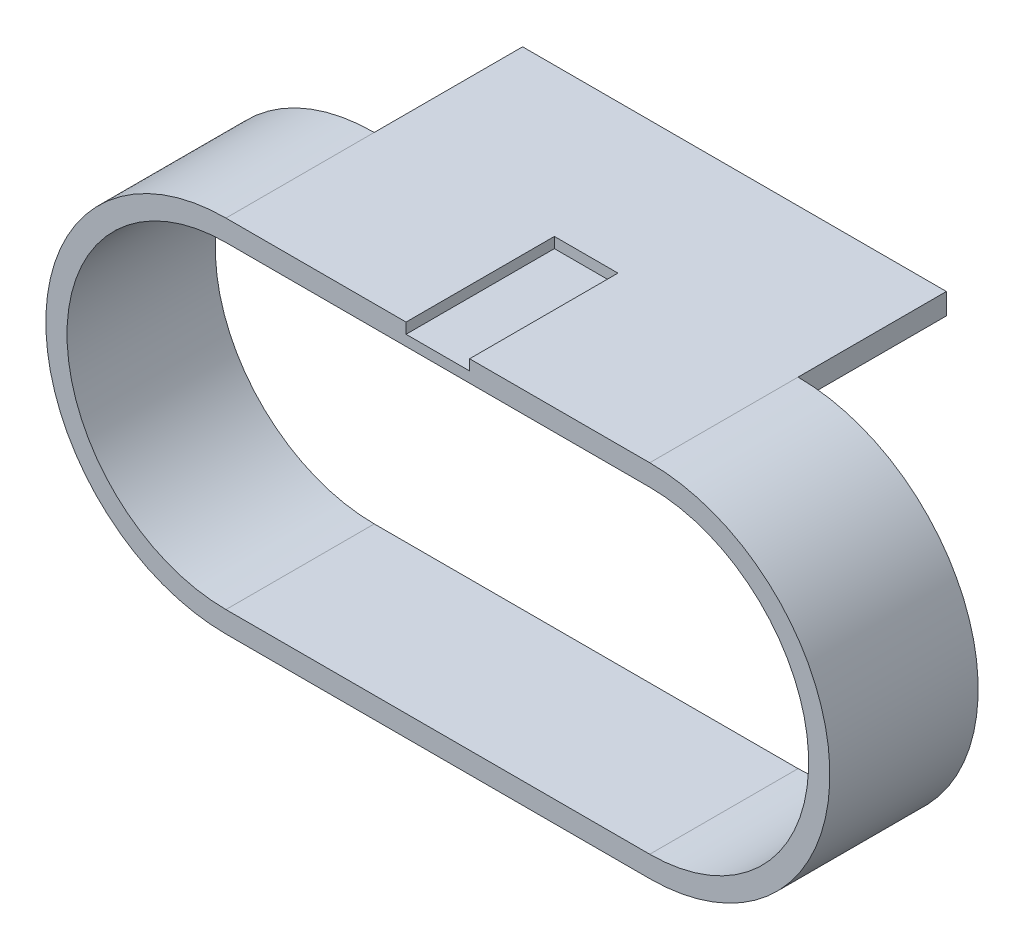
ISO-10303-21;
HEADER;
FILE_DESCRIPTION(('STEP AP214'),'2;1');
FILE_NAME('part.step','',(''),(''),'','','');
FILE_SCHEMA(('AUTOMOTIVE_DESIGN { 1 0 10303 214 1 1 1 1 }'));
ENDSEC;
DATA;
#1=APPLICATION_CONTEXT('core data for automotive mechanical design processes');
#2=APPLICATION_PROTOCOL_DEFINITION('international standard','automotive_design',2000,#1);
#3=PRODUCT_CONTEXT('',#1,'mechanical');
#4=PRODUCT('Part','Part','',(#3));
#5=PRODUCT_RELATED_PRODUCT_CATEGORY('part','',(#4));
#6=PRODUCT_DEFINITION_FORMATION('','',#4);
#7=PRODUCT_DEFINITION_CONTEXT('part definition',#1,'design');
#8=PRODUCT_DEFINITION('design','',#6,#7);
#9=PRODUCT_DEFINITION_SHAPE('','',#8);
#10=(LENGTH_UNIT() NAMED_UNIT(*) SI_UNIT(.MILLI.,.METRE.));
#11=(NAMED_UNIT(*) PLANE_ANGLE_UNIT() SI_UNIT($,.RADIAN.));
#12=(NAMED_UNIT(*) SI_UNIT($,.STERADIAN.) SOLID_ANGLE_UNIT());
#13=UNCERTAINTY_MEASURE_WITH_UNIT(LENGTH_MEASURE(1.E-05),#10,'distance_accuracy_value','');
#14=(GEOMETRIC_REPRESENTATION_CONTEXT(3) GLOBAL_UNCERTAINTY_ASSIGNED_CONTEXT((#13)) GLOBAL_UNIT_ASSIGNED_CONTEXT((#10,
#11,#12)) REPRESENTATION_CONTEXT('',''));
#15=CARTESIAN_POINT('',(0.,0.,0.));
#16=DIRECTION('',(0.,0.,1.));
#17=DIRECTION('',(1.,0.,0.));
#18=AXIS2_PLACEMENT_3D('',#15,#16,#17);
#19=CARTESIAN_POINT('',(-25.4,0.,-8.89));
#20=DIRECTION('',(0.,0.,1.));
#21=DIRECTION('',(1.,0.,0.));
#22=AXIS2_PLACEMENT_3D('',#19,#20,#21);
#23=PLANE('',#22);
#24=DIRECTION('',(0.,-1.,0.));
#25=VECTOR('',#24,1.);
#26=CARTESIAN_POINT('',(25.4,21.59,-8.89));
#27=LINE('',#26,#25);
#28=CARTESIAN_POINT('',(25.4,21.59,-8.89));
#29=VERTEX_POINT('',#28);
#30=CARTESIAN_POINT('',(25.4,19.05,-8.89));
#31=VERTEX_POINT('',#30);
#32=EDGE_CURVE('E160',#29,#31,#27,.T.);
#33=ORIENTED_EDGE('',*,*,#32,.F.);
#34=CARTESIAN_POINT('',(25.4,0.,-8.89));
#35=DIRECTION('',(0.,0.,1.));
#36=DIRECTION('',(1.,0.,0.));
#37=AXIS2_PLACEMENT_3D('',#34,#35,#36);
#38=CIRCLE('',#37,21.59);
#39=CARTESIAN_POINT('',(25.4,-21.59,-8.89));
#40=VERTEX_POINT('',#39);
#41=EDGE_CURVE('E220',#40,#29,#38,.T.);
#42=ORIENTED_EDGE('',*,*,#41,.F.);
#43=DIRECTION('',(1.,0.,0.));
#44=VECTOR('',#43,1.);
#45=CARTESIAN_POINT('',(-25.4,-21.59,-8.89));
#46=LINE('',#45,#44);
#47=CARTESIAN_POINT('',(-25.4,-21.59,-8.89));
#48=VERTEX_POINT('',#47);
#49=EDGE_CURVE('E231',#48,#40,#46,.T.);
#50=ORIENTED_EDGE('',*,*,#49,.F.);
#51=CARTESIAN_POINT('',(-25.4,0.,-8.89));
#52=DIRECTION('',(0.,0.,1.));
#53=DIRECTION('',(1.,0.,0.));
#54=AXIS2_PLACEMENT_3D('',#51,#52,#53);
#55=CIRCLE('',#54,21.59);
#56=CARTESIAN_POINT('',(-25.4,21.59,-8.89));
#57=VERTEX_POINT('',#56);
#58=EDGE_CURVE('E215',#57,#48,#55,.T.);
#59=ORIENTED_EDGE('',*,*,#58,.F.);
#60=DIRECTION('',(0.,1.,0.));
#61=VECTOR('',#60,1.);
#62=CARTESIAN_POINT('',(-25.4,21.59,-8.89));
#63=LINE('',#62,#61);
#64=CARTESIAN_POINT('',(-25.4,19.05,-8.89));
#65=VERTEX_POINT('',#64);
#66=EDGE_CURVE('E249',#65,#57,#63,.T.);
#67=ORIENTED_EDGE('',*,*,#66,.F.);
#68=CARTESIAN_POINT('',(-25.4,0.,-8.89));
#69=DIRECTION('',(0.,0.,1.));
#70=DIRECTION('',(1.,0.,0.));
#71=AXIS2_PLACEMENT_3D('',#68,#69,#70);
#72=CIRCLE('',#71,19.05);
#73=CARTESIAN_POINT('',(-25.4,-19.05,-8.89));
#74=VERTEX_POINT('',#73);
#75=EDGE_CURVE('E190',#65,#74,#72,.T.);
#76=ORIENTED_EDGE('',*,*,#75,.T.);
#77=DIRECTION('',(1.,0.,0.));
#78=VECTOR('',#77,1.);
#79=CARTESIAN_POINT('',(-25.4,-19.05,-8.89));
#80=LINE('',#79,#78);
#81=CARTESIAN_POINT('',(25.4,-19.05,-8.89));
#82=VERTEX_POINT('',#81);
#83=EDGE_CURVE('E203',#74,#82,#80,.T.);
#84=ORIENTED_EDGE('',*,*,#83,.T.);
#85=CARTESIAN_POINT('',(25.4,0.,-8.89));
#86=DIRECTION('',(0.,0.,1.));
#87=DIRECTION('',(1.,0.,0.));
#88=AXIS2_PLACEMENT_3D('',#85,#86,#87);
#89=CIRCLE('',#88,19.05);
#90=EDGE_CURVE('E194',#82,#31,#89,.T.);
#91=ORIENTED_EDGE('',*,*,#90,.T.);
#92=EDGE_LOOP('',(#33,#42,#50,#59,#67,#76,#84,#91));
#93=FACE_BOUND('',#92,.T.);
#94=ADVANCED_FACE('F37',(#93),#23,.F.);
#95=CARTESIAN_POINT('',(-25.4,0.,8.89));
#96=DIRECTION('',(0.,0.,1.));
#97=DIRECTION('',(1.,0.,0.));
#98=AXIS2_PLACEMENT_3D('',#95,#96,#97);
#99=PLANE('',#98);
#100=DIRECTION('',(1.,0.,0.));
#101=VECTOR('',#100,1.);
#102=CARTESIAN_POINT('',(-25.4,-19.05,8.89));
#103=LINE('',#102,#101);
#104=CARTESIAN_POINT('',(-25.4,-19.05,8.89));
#105=VERTEX_POINT('',#104);
#106=CARTESIAN_POINT('',(25.4,-19.05,8.89));
#107=VERTEX_POINT('',#106);
#108=EDGE_CURVE('E193',#105,#107,#103,.T.);
#109=ORIENTED_EDGE('',*,*,#108,.F.);
#110=CARTESIAN_POINT('',(-25.4,0.,8.89));
#111=DIRECTION('',(0.,0.,1.));
#112=DIRECTION('',(1.,0.,0.));
#113=AXIS2_PLACEMENT_3D('',#110,#111,#112);
#114=CIRCLE('',#113,19.05);
#115=CARTESIAN_POINT('',(-25.4,19.05,8.89));
#116=VERTEX_POINT('',#115);
#117=EDGE_CURVE('E191',#116,#105,#114,.T.);
#118=ORIENTED_EDGE('',*,*,#117,.F.);
#119=DIRECTION('',(-1.,0.,0.));
#120=VECTOR('',#119,1.);
#121=CARTESIAN_POINT('',(-25.4,19.05,8.89));
#122=LINE('',#121,#120);
#123=CARTESIAN_POINT('',(25.4,19.05,8.89));
#124=VERTEX_POINT('',#123);
#125=EDGE_CURVE('E198',#124,#116,#122,.T.);
#126=ORIENTED_EDGE('',*,*,#125,.F.);
#127=CARTESIAN_POINT('',(25.4,0.,8.89));
#128=DIRECTION('',(0.,0.,1.));
#129=DIRECTION('',(1.,0.,0.));
#130=AXIS2_PLACEMENT_3D('',#127,#128,#129);
#131=CIRCLE('',#130,19.05);
#132=EDGE_CURVE('E196',#107,#124,#131,.T.);
#133=ORIENTED_EDGE('',*,*,#132,.F.);
#134=EDGE_LOOP('',(#109,#118,#126,#133));
#135=FACE_BOUND('',#134,.T.);
#136=DIRECTION('',(-1.,0.,0.));
#137=VECTOR('',#136,1.);
#138=CARTESIAN_POINT('',(-25.4,21.59,8.89));
#139=LINE('',#138,#137);
#140=CARTESIAN_POINT('',(25.4,21.59,8.89));
#141=VERTEX_POINT('',#140);
#142=CARTESIAN_POINT('',(3.81,21.59,8.89));
#143=VERTEX_POINT('',#142);
#144=EDGE_CURVE('E225',#141,#143,#139,.T.);
#145=ORIENTED_EDGE('',*,*,#144,.T.);
#146=DIRECTION('',(0.,1.,0.));
#147=VECTOR('',#146,1.);
#148=CARTESIAN_POINT('',(3.81,20.32,8.89));
#149=LINE('',#148,#147);
#150=CARTESIAN_POINT('',(3.81,20.32,8.89));
#151=VERTEX_POINT('',#150);
#152=EDGE_CURVE('E181',#151,#143,#149,.T.);
#153=ORIENTED_EDGE('',*,*,#152,.F.);
#154=DIRECTION('',(1.,0.,0.));
#155=VECTOR('',#154,1.);
#156=CARTESIAN_POINT('',(-3.81,20.32,8.89));
#157=LINE('',#156,#155);
#158=CARTESIAN_POINT('',(-3.81,20.32,8.89));
#159=VERTEX_POINT('',#158);
#160=EDGE_CURVE('E187',#159,#151,#157,.T.);
#161=ORIENTED_EDGE('',*,*,#160,.F.);
#162=DIRECTION('',(0.,-1.,0.));
#163=VECTOR('',#162,1.);
#164=CARTESIAN_POINT('',(-3.81,20.32,8.89));
#165=LINE('',#164,#163);
#166=CARTESIAN_POINT('',(-3.81,21.59,8.89));
#167=VERTEX_POINT('',#166);
#168=EDGE_CURVE('E178',#167,#159,#165,.T.);
#169=ORIENTED_EDGE('',*,*,#168,.F.);
#170=CARTESIAN_POINT('',(-25.4,21.59,8.89));
#171=VERTEX_POINT('',#170);
#172=EDGE_CURVE('E224',#167,#171,#139,.T.);
#173=ORIENTED_EDGE('',*,*,#172,.T.);
#174=CARTESIAN_POINT('',(-25.4,0.,8.89));
#175=DIRECTION('',(0.,0.,1.));
#176=DIRECTION('',(1.,0.,0.));
#177=AXIS2_PLACEMENT_3D('',#174,#175,#176);
#178=CIRCLE('',#177,21.59);
#179=CARTESIAN_POINT('',(-25.4,-21.59,8.89));
#180=VERTEX_POINT('',#179);
#181=EDGE_CURVE('E216',#171,#180,#178,.T.);
#182=ORIENTED_EDGE('',*,*,#181,.T.);
#183=DIRECTION('',(1.,0.,0.));
#184=VECTOR('',#183,1.);
#185=CARTESIAN_POINT('',(-25.4,-21.59,8.89));
#186=LINE('',#185,#184);
#187=CARTESIAN_POINT('',(25.4,-21.59,8.89));
#188=VERTEX_POINT('',#187);
#189=EDGE_CURVE('E219',#180,#188,#186,.T.);
#190=ORIENTED_EDGE('',*,*,#189,.T.);
#191=CARTESIAN_POINT('',(25.4,0.,8.89));
#192=DIRECTION('',(0.,0.,1.));
#193=DIRECTION('',(1.,0.,0.));
#194=AXIS2_PLACEMENT_3D('',#191,#192,#193);
#195=CIRCLE('',#194,21.59);
#196=EDGE_CURVE('E222',#188,#141,#195,.T.);
#197=ORIENTED_EDGE('',*,*,#196,.T.);
#198=EDGE_LOOP('',(#145,#153,#161,#169,#173,#182,#190,#197));
#199=FACE_BOUND('',#198,.T.);
#200=ADVANCED_FACE('F278',(#135,#199),#99,.T.);
#201=CARTESIAN_POINT('',(-25.4,21.59,8.89));
#202=DIRECTION('',(0.,-1.,0.));
#203=DIRECTION('',(1.,0.,0.));
#204=AXIS2_PLACEMENT_3D('',#201,#202,#203);
#205=PLANE('',#204);
#206=DIRECTION('',(0.,0.,-1.));
#207=VECTOR('',#206,1.);
#208=CARTESIAN_POINT('',(-3.81,21.59,8.891));
#209=LINE('',#208,#207);
#210=CARTESIAN_POINT('',(-3.81,21.59,-8.89));
#211=VERTEX_POINT('',#210);
#212=EDGE_CURVE('E173',#167,#211,#209,.T.);
#213=ORIENTED_EDGE('',*,*,#212,.T.);
#214=DIRECTION('',(1.,0.,0.));
#215=VECTOR('',#214,1.);
#216=CARTESIAN_POINT('',(25.4,21.59,-8.89));
#217=LINE('',#216,#215);
#218=CARTESIAN_POINT('',(3.81,21.59,-8.89));
#219=VERTEX_POINT('',#218);
#220=EDGE_CURVE('E157',#211,#219,#217,.T.);
#221=ORIENTED_EDGE('',*,*,#220,.T.);
#222=DIRECTION('',(0.,0.,1.));
#223=VECTOR('',#222,1.);
#224=CARTESIAN_POINT('',(3.81,21.59,8.891));
#225=LINE('',#224,#223);
#226=EDGE_CURVE('E175',#219,#143,#225,.T.);
#227=ORIENTED_EDGE('',*,*,#226,.T.);
#228=ORIENTED_EDGE('',*,*,#144,.F.);
#229=DIRECTION('',(0.,0.,-1.));
#230=VECTOR('',#229,1.);
#231=CARTESIAN_POINT('',(25.4,21.59,8.89));
#232=LINE('',#231,#230);
#233=EDGE_CURVE('E237',#141,#29,#232,.T.);
#234=ORIENTED_EDGE('',*,*,#233,.T.);
#235=DIRECTION('',(0.,0.,1.));
#236=VECTOR('',#235,1.);
#237=CARTESIAN_POINT('',(25.4,21.59,-26.67));
#238=LINE('',#237,#236);
#239=CARTESIAN_POINT('',(25.4,21.59,-26.67));
#240=VERTEX_POINT('',#239);
#241=EDGE_CURVE('E258',#240,#29,#238,.T.);
#242=ORIENTED_EDGE('',*,*,#241,.F.);
#243=DIRECTION('',(1.,0.,0.));
#244=VECTOR('',#243,1.);
#245=CARTESIAN_POINT('',(25.4,21.59,-26.67));
#246=LINE('',#245,#244);
#247=CARTESIAN_POINT('',(-25.4,21.59,-26.67));
#248=VERTEX_POINT('',#247);
#249=EDGE_CURVE('E153',#248,#240,#246,.T.);
#250=ORIENTED_EDGE('',*,*,#249,.F.);
#251=DIRECTION('',(0.,0.,1.));
#252=VECTOR('',#251,1.);
#253=CARTESIAN_POINT('',(-25.4,21.59,-26.67));
#254=LINE('',#253,#252);
#255=EDGE_CURVE('E166',#248,#57,#254,.T.);
#256=ORIENTED_EDGE('',*,*,#255,.T.);
#257=DIRECTION('',(0.,0.,-1.));
#258=VECTOR('',#257,1.);
#259=CARTESIAN_POINT('',(-25.4,21.59,8.89));
#260=LINE('',#259,#258);
#261=EDGE_CURVE('E228',#171,#57,#260,.T.);
#262=ORIENTED_EDGE('',*,*,#261,.F.);
#263=ORIENTED_EDGE('',*,*,#172,.F.);
#264=EDGE_LOOP('',(#213,#221,#227,#228,#234,#242,#250,#256,#262,#263));
#265=FACE_BOUND('',#264,.T.);
#266=ADVANCED_FACE('F263',(#265),#205,.F.);
#267=CARTESIAN_POINT('',(-25.4,0.,8.89));
#268=DIRECTION('',(0.,0.,-1.));
#269=DIRECTION('',(-1.,0.,0.));
#270=AXIS2_PLACEMENT_3D('',#267,#268,#269);
#271=CYLINDRICAL_SURFACE('',#270,21.59);
#272=ORIENTED_EDGE('',*,*,#58,.T.);
#273=DIRECTION('',(0.,0.,-1.));
#274=VECTOR('',#273,1.);
#275=CARTESIAN_POINT('',(-25.4,-21.59,8.89));
#276=LINE('',#275,#274);
#277=EDGE_CURVE('E11',#180,#48,#276,.T.);
#278=ORIENTED_EDGE('',*,*,#277,.F.);
#279=ORIENTED_EDGE('',*,*,#181,.F.);
#280=ORIENTED_EDGE('',*,*,#261,.T.);
#281=EDGE_LOOP('',(#272,#278,#279,#280));
#282=FACE_BOUND('',#281,.T.);
#283=ADVANCED_FACE('F39',(#282),#271,.T.);
#284=CARTESIAN_POINT('',(-25.4,-21.59,8.89));
#285=DIRECTION('',(0.,1.,0.));
#286=DIRECTION('',(0.,0.,1.));
#287=AXIS2_PLACEMENT_3D('',#284,#285,#286);
#288=PLANE('',#287);
#289=ORIENTED_EDGE('',*,*,#49,.T.);
#290=DIRECTION('',(0.,0.,-1.));
#291=VECTOR('',#290,1.);
#292=CARTESIAN_POINT('',(25.4,-21.59,8.89));
#293=LINE('',#292,#291);
#294=EDGE_CURVE('E45',#188,#40,#293,.T.);
#295=ORIENTED_EDGE('',*,*,#294,.F.);
#296=ORIENTED_EDGE('',*,*,#189,.F.);
#297=ORIENTED_EDGE('',*,*,#277,.T.);
#298=EDGE_LOOP('',(#289,#295,#296,#297));
#299=FACE_BOUND('',#298,.T.);
#300=ADVANCED_FACE('F305',(#299),#288,.F.);
#301=CARTESIAN_POINT('',(25.4,0.,8.89));
#302=DIRECTION('',(0.,0.,-1.));
#303=DIRECTION('',(-1.,0.,0.));
#304=AXIS2_PLACEMENT_3D('',#301,#302,#303);
#305=CYLINDRICAL_SURFACE('',#304,21.59);
#306=ORIENTED_EDGE('',*,*,#41,.T.);
#307=ORIENTED_EDGE('',*,*,#233,.F.);
#308=ORIENTED_EDGE('',*,*,#196,.F.);
#309=ORIENTED_EDGE('',*,*,#294,.T.);
#310=EDGE_LOOP('',(#306,#307,#308,#309));
#311=FACE_BOUND('',#310,.T.);
#312=ADVANCED_FACE('F244',(#311),#305,.T.);
#313=CARTESIAN_POINT('',(-25.4,0.,8.89));
#314=DIRECTION('',(0.,0.,-1.));
#315=DIRECTION('',(-1.,0.,0.));
#316=AXIS2_PLACEMENT_3D('',#313,#314,#315);
#317=CYLINDRICAL_SURFACE('',#316,19.05);
#318=ORIENTED_EDGE('',*,*,#75,.F.);
#319=DIRECTION('',(0.,0.,-1.));
#320=VECTOR('',#319,1.);
#321=CARTESIAN_POINT('',(-25.4,19.05,8.89));
#322=LINE('',#321,#320);
#323=EDGE_CURVE('E200',#116,#65,#322,.T.);
#324=ORIENTED_EDGE('',*,*,#323,.F.);
#325=ORIENTED_EDGE('',*,*,#117,.T.);
#326=DIRECTION('',(0.,0.,-1.));
#327=VECTOR('',#326,1.);
#328=CARTESIAN_POINT('',(-25.4,-19.05,8.89));
#329=LINE('',#328,#327);
#330=EDGE_CURVE('E212',#105,#74,#329,.T.);
#331=ORIENTED_EDGE('',*,*,#330,.T.);
#332=EDGE_LOOP('',(#318,#324,#325,#331));
#333=FACE_BOUND('',#332,.T.);
#334=ADVANCED_FACE('F271',(#333),#317,.F.);
#335=CARTESIAN_POINT('',(-25.4,-19.05,8.89));
#336=DIRECTION('',(0.,1.,0.));
#337=DIRECTION('',(0.,0.,1.));
#338=AXIS2_PLACEMENT_3D('',#335,#336,#337);
#339=PLANE('',#338);
#340=ORIENTED_EDGE('',*,*,#83,.F.);
#341=ORIENTED_EDGE('',*,*,#330,.F.);
#342=ORIENTED_EDGE('',*,*,#108,.T.);
#343=DIRECTION('',(0.,0.,-1.));
#344=VECTOR('',#343,1.);
#345=CARTESIAN_POINT('',(25.4,-19.05,8.89));
#346=LINE('',#345,#344);
#347=EDGE_CURVE('E210',#107,#82,#346,.T.);
#348=ORIENTED_EDGE('',*,*,#347,.T.);
#349=EDGE_LOOP('',(#340,#341,#342,#348));
#350=FACE_BOUND('',#349,.T.);
#351=ADVANCED_FACE('F281',(#350),#339,.T.);
#352=CARTESIAN_POINT('',(25.4,0.,8.89));
#353=DIRECTION('',(0.,0.,-1.));
#354=DIRECTION('',(-1.,0.,0.));
#355=AXIS2_PLACEMENT_3D('',#352,#353,#354);
#356=CYLINDRICAL_SURFACE('',#355,19.05);
#357=ORIENTED_EDGE('',*,*,#90,.F.);
#358=ORIENTED_EDGE('',*,*,#347,.F.);
#359=ORIENTED_EDGE('',*,*,#132,.T.);
#360=DIRECTION('',(0.,0.,-1.));
#361=VECTOR('',#360,1.);
#362=CARTESIAN_POINT('',(25.4,19.05,8.89));
#363=LINE('',#362,#361);
#364=EDGE_CURVE('E60',#124,#31,#363,.T.);
#365=ORIENTED_EDGE('',*,*,#364,.T.);
#366=EDGE_LOOP('',(#357,#358,#359,#365));
#367=FACE_BOUND('',#366,.T.);
#368=ADVANCED_FACE('F284',(#367),#356,.F.);
#369=CARTESIAN_POINT('',(-25.4,19.05,8.89));
#370=DIRECTION('',(0.,-1.,0.));
#371=DIRECTION('',(0.,0.,-1.));
#372=AXIS2_PLACEMENT_3D('',#369,#370,#371);
#373=PLANE('',#372);
#374=ORIENTED_EDGE('',*,*,#323,.T.);
#375=DIRECTION('',(0.,0.,1.));
#376=VECTOR('',#375,1.);
#377=CARTESIAN_POINT('',(-25.4,19.05,-26.67));
#378=LINE('',#377,#376);
#379=CARTESIAN_POINT('',(-25.4,19.05,-26.67));
#380=VERTEX_POINT('',#379);
#381=EDGE_CURVE('E144',#380,#65,#378,.T.);
#382=ORIENTED_EDGE('',*,*,#381,.F.);
#383=DIRECTION('',(-1.,0.,0.));
#384=VECTOR('',#383,1.);
#385=CARTESIAN_POINT('',(25.4,19.05,-26.67));
#386=LINE('',#385,#384);
#387=CARTESIAN_POINT('',(25.4,19.05,-26.67));
#388=VERTEX_POINT('',#387);
#389=EDGE_CURVE('E136',#388,#380,#386,.T.);
#390=ORIENTED_EDGE('',*,*,#389,.F.);
#391=DIRECTION('',(0.,0.,1.));
#392=VECTOR('',#391,1.);
#393=CARTESIAN_POINT('',(25.4,19.05,-26.67));
#394=LINE('',#393,#392);
#395=EDGE_CURVE('E141',#388,#31,#394,.T.);
#396=ORIENTED_EDGE('',*,*,#395,.T.);
#397=ORIENTED_EDGE('',*,*,#364,.F.);
#398=ORIENTED_EDGE('',*,*,#125,.T.);
#399=EDGE_LOOP('',(#374,#382,#390,#396,#397,#398));
#400=FACE_BOUND('',#399,.T.);
#401=ADVANCED_FACE('F139',(#400),#373,.T.);
#402=CARTESIAN_POINT('',(3.81,20.32,8.891));
#403=DIRECTION('',(-1.,0.,0.));
#404=DIRECTION('',(0.,0.,1.));
#405=AXIS2_PLACEMENT_3D('',#402,#403,#404);
#406=PLANE('',#405);
#407=ORIENTED_EDGE('',*,*,#152,.T.);
#408=ORIENTED_EDGE('',*,*,#226,.F.);
#409=DIRECTION('',(0.,-1.,0.));
#410=VECTOR('',#409,1.);
#411=CARTESIAN_POINT('',(3.81,20.32,-8.89));
#412=LINE('',#411,#410);
#413=CARTESIAN_POINT('',(3.81,20.32,-8.89));
#414=VERTEX_POINT('',#413);
#415=EDGE_CURVE('E164',#219,#414,#412,.T.);
#416=ORIENTED_EDGE('',*,*,#415,.T.);
#417=DIRECTION('',(0.,0.,-1.));
#418=VECTOR('',#417,1.);
#419=CARTESIAN_POINT('',(3.81,20.32,8.891));
#420=LINE('',#419,#418);
#421=EDGE_CURVE('E183',#151,#414,#420,.T.);
#422=ORIENTED_EDGE('',*,*,#421,.F.);
#423=EDGE_LOOP('',(#407,#408,#416,#422));
#424=FACE_BOUND('',#423,.T.);
#425=ADVANCED_FACE('F291',(#424),#406,.T.);
#426=CARTESIAN_POINT('',(-3.81,20.32,8.891));
#427=DIRECTION('',(1.,0.,0.));
#428=DIRECTION('',(0.,0.,-1.));
#429=AXIS2_PLACEMENT_3D('',#426,#427,#428);
#430=PLANE('',#429);
#431=ORIENTED_EDGE('',*,*,#168,.T.);
#432=DIRECTION('',(0.,0.,-1.));
#433=VECTOR('',#432,1.);
#434=CARTESIAN_POINT('',(-3.81,20.32,8.891));
#435=LINE('',#434,#433);
#436=CARTESIAN_POINT('',(-3.81,20.32,-8.89));
#437=VERTEX_POINT('',#436);
#438=EDGE_CURVE('E185',#159,#437,#435,.T.);
#439=ORIENTED_EDGE('',*,*,#438,.T.);
#440=DIRECTION('',(0.,1.,0.));
#441=VECTOR('',#440,1.);
#442=CARTESIAN_POINT('',(-3.81,20.32,-8.89));
#443=LINE('',#442,#441);
#444=EDGE_CURVE('E52',#437,#211,#443,.T.);
#445=ORIENTED_EDGE('',*,*,#444,.T.);
#446=ORIENTED_EDGE('',*,*,#212,.F.);
#447=EDGE_LOOP('',(#431,#439,#445,#446));
#448=FACE_BOUND('',#447,.T.);
#449=ADVANCED_FACE('F324',(#448),#430,.T.);
#450=CARTESIAN_POINT('',(-3.81,20.32,8.891));
#451=DIRECTION('',(0.,1.,0.));
#452=DIRECTION('',(0.,0.,1.));
#453=AXIS2_PLACEMENT_3D('',#450,#451,#452);
#454=PLANE('',#453);
#455=ORIENTED_EDGE('',*,*,#160,.T.);
#456=ORIENTED_EDGE('',*,*,#421,.T.);
#457=DIRECTION('',(-1.,0.,0.));
#458=VECTOR('',#457,1.);
#459=CARTESIAN_POINT('',(-3.81,20.32,-8.89));
#460=LINE('',#459,#458);
#461=EDGE_CURVE('E161',#414,#437,#460,.T.);
#462=ORIENTED_EDGE('',*,*,#461,.T.);
#463=ORIENTED_EDGE('',*,*,#438,.F.);
#464=EDGE_LOOP('',(#455,#456,#462,#463));
#465=FACE_BOUND('',#464,.T.);
#466=ADVANCED_FACE('F323',(#465),#454,.T.);
#467=CARTESIAN_POINT('',(25.4,21.59,-26.67));
#468=DIRECTION('',(-1.,0.,0.));
#469=DIRECTION('',(0.,0.,1.));
#470=AXIS2_PLACEMENT_3D('',#467,#468,#469);
#471=PLANE('',#470);
#472=ORIENTED_EDGE('',*,*,#32,.T.);
#473=ORIENTED_EDGE('',*,*,#395,.F.);
#474=DIRECTION('',(0.,-1.,0.));
#475=VECTOR('',#474,1.);
#476=CARTESIAN_POINT('',(25.4,21.59,-26.67));
#477=LINE('',#476,#475);
#478=EDGE_CURVE('E148',#240,#388,#477,.T.);
#479=ORIENTED_EDGE('',*,*,#478,.F.);
#480=ORIENTED_EDGE('',*,*,#241,.T.);
#481=EDGE_LOOP('',(#472,#473,#479,#480));
#482=FACE_BOUND('',#481,.T.);
#483=ADVANCED_FACE('F159',(#482),#471,.F.);
#484=CARTESIAN_POINT('',(-25.4,21.59,-26.67));
#485=DIRECTION('',(1.,0.,0.));
#486=DIRECTION('',(0.,0.,-1.));
#487=AXIS2_PLACEMENT_3D('',#484,#485,#486);
#488=PLANE('',#487);
#489=ORIENTED_EDGE('',*,*,#66,.T.);
#490=ORIENTED_EDGE('',*,*,#255,.F.);
#491=DIRECTION('',(0.,1.,0.));
#492=VECTOR('',#491,1.);
#493=CARTESIAN_POINT('',(-25.4,21.59,-26.67));
#494=LINE('',#493,#492);
#495=EDGE_CURVE('E147',#380,#248,#494,.T.);
#496=ORIENTED_EDGE('',*,*,#495,.F.);
#497=ORIENTED_EDGE('',*,*,#381,.T.);
#498=EDGE_LOOP('',(#489,#490,#496,#497));
#499=FACE_BOUND('',#498,.T.);
#500=ADVANCED_FACE('F267',(#499),#488,.F.);
#501=CARTESIAN_POINT('',(0.,0.,-26.67));
#502=DIRECTION('',(0.,0.,-1.));
#503=DIRECTION('',(-1.,0.,0.));
#504=AXIS2_PLACEMENT_3D('',#501,#502,#503);
#505=PLANE('',#504);
#506=ORIENTED_EDGE('',*,*,#478,.T.);
#507=ORIENTED_EDGE('',*,*,#389,.T.);
#508=ORIENTED_EDGE('',*,*,#495,.T.);
#509=ORIENTED_EDGE('',*,*,#249,.T.);
#510=EDGE_LOOP('',(#506,#507,#508,#509));
#511=FACE_BOUND('',#510,.T.);
#512=ADVANCED_FACE('F151',(#511),#505,.T.);
#513=CARTESIAN_POINT('',(0.,0.,-8.89));
#514=DIRECTION('',(0.,0.,-1.));
#515=DIRECTION('',(-1.,0.,0.));
#516=AXIS2_PLACEMENT_3D('',#513,#514,#515);
#517=PLANE('',#516);
#518=ORIENTED_EDGE('',*,*,#415,.F.);
#519=ORIENTED_EDGE('',*,*,#220,.F.);
#520=ORIENTED_EDGE('',*,*,#444,.F.);
#521=ORIENTED_EDGE('',*,*,#461,.F.);
#522=EDGE_LOOP('',(#518,#519,#520,#521));
#523=FACE_BOUND('',#522,.T.);
#524=ADVANCED_FACE('F317',(#523),#517,.F.);
#525=CLOSED_SHELL('',(#94,#200,#266,#283,#300,#312,#334,#351,#368,#401,#425,#449,#466,#483,#500,
#512,#524));
#526=MANIFOLD_SOLID_BREP('B2',#525);
#527=ADVANCED_BREP_SHAPE_REPRESENTATION('',(#18,#526),#14);
#528=SHAPE_DEFINITION_REPRESENTATION(#9,#527);
ENDSEC;
END-ISO-10303-21;
